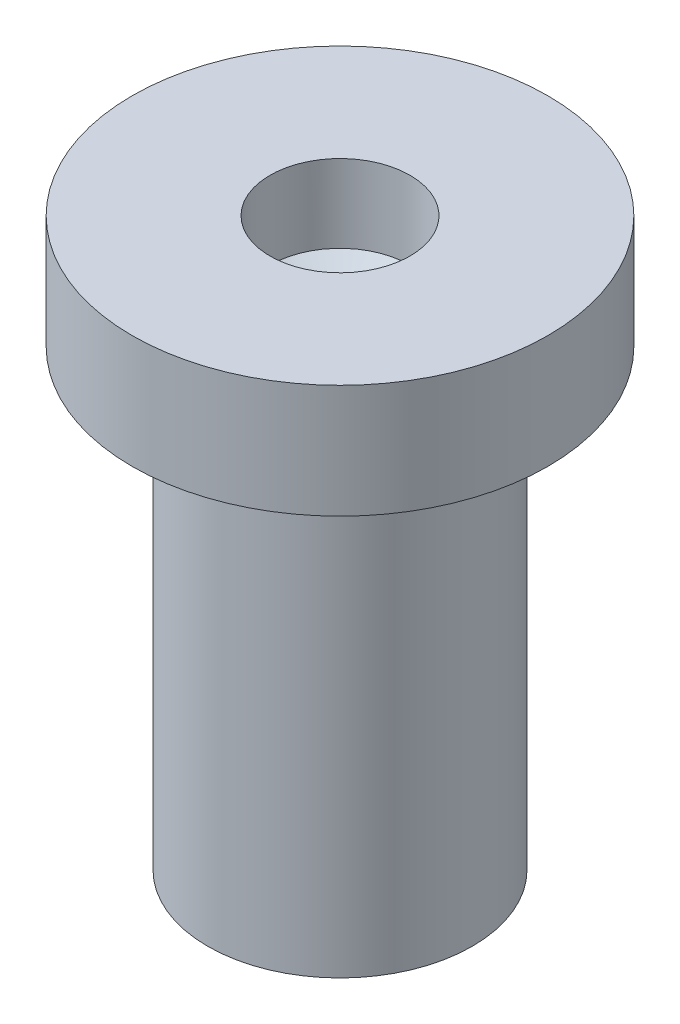
ISO-10303-21;
HEADER;
FILE_DESCRIPTION(('STEP AP214'),'2;1');
FILE_NAME('part.step','',(''),(''),'','','');
FILE_SCHEMA(('AUTOMOTIVE_DESIGN { 1 0 10303 214 1 1 1 1 }'));
ENDSEC;
DATA;
#1=APPLICATION_CONTEXT('core data for automotive mechanical design processes');
#2=APPLICATION_PROTOCOL_DEFINITION('international standard','automotive_design',2000,#1);
#3=PRODUCT_CONTEXT('',#1,'mechanical');
#4=PRODUCT('Part','Part','',(#3));
#5=PRODUCT_RELATED_PRODUCT_CATEGORY('part','',(#4));
#6=PRODUCT_DEFINITION_FORMATION('','',#4);
#7=PRODUCT_DEFINITION_CONTEXT('part definition',#1,'design');
#8=PRODUCT_DEFINITION('design','',#6,#7);
#9=PRODUCT_DEFINITION_SHAPE('','',#8);
#10=(LENGTH_UNIT() NAMED_UNIT(*) SI_UNIT(.MILLI.,.METRE.));
#11=(NAMED_UNIT(*) PLANE_ANGLE_UNIT() SI_UNIT($,.RADIAN.));
#12=(NAMED_UNIT(*) SI_UNIT($,.STERADIAN.) SOLID_ANGLE_UNIT());
#13=UNCERTAINTY_MEASURE_WITH_UNIT(LENGTH_MEASURE(1.E-05),#10,'distance_accuracy_value','');
#14=(GEOMETRIC_REPRESENTATION_CONTEXT(3) GLOBAL_UNCERTAINTY_ASSIGNED_CONTEXT((#13)) GLOBAL_UNIT_ASSIGNED_CONTEXT((#10,
#11,#12)) REPRESENTATION_CONTEXT('',''));
#15=CARTESIAN_POINT('',(0.,0.,0.));
#16=DIRECTION('',(0.,0.,1.));
#17=DIRECTION('',(1.,0.,0.));
#18=AXIS2_PLACEMENT_3D('',#15,#16,#17);
#19=CARTESIAN_POINT('',(0.,6.47053649932942,0.));
#20=DIRECTION('',(0.,1.,0.));
#21=DIRECTION('',(0.,0.,1.));
#22=AXIS2_PLACEMENT_3D('',#19,#20,#21);
#23=CONICAL_SURFACE('',#22,0.926555570704264,1.10090111001775);
#24=CARTESIAN_POINT('',(0.,6.,0.));
#25=VERTEX_POINT('',#24);
#26=VERTEX_LOOP('',#25);
#27=FACE_BOUND('',#26,.T.);
#28=CARTESIAN_POINT('',(0.,6.47053649932942,0.));
#29=DIRECTION('',(0.,-1.,0.));
#30=DIRECTION('',(0.,0.,-1.));
#31=AXIS2_PLACEMENT_3D('',#28,#29,#30);
#32=CIRCLE('',#31,0.926555570704264);
#33=CARTESIAN_POINT('',(0.,6.47053649932942,-0.926555570704264));
#34=VERTEX_POINT('',#33);
#35=EDGE_CURVE('E11',#34,#34,#32,.T.);
#36=ORIENTED_EDGE('',*,*,#35,.F.);
#37=EDGE_LOOP('',(#36));
#38=FACE_BOUND('',#37,.T.);
#39=ADVANCED_FACE('F39',(#27,#38),#23,.F.);
#40=CARTESIAN_POINT('',(0.,0.,0.));
#41=DIRECTION('',(0.,-1.,0.));
#42=DIRECTION('',(0.,0.,-1.));
#43=AXIS2_PLACEMENT_3D('',#40,#41,#42);
#44=CYLINDRICAL_SURFACE('',#43,0.926555570704264);
#45=ORIENTED_EDGE('',*,*,#35,.T.);
#46=EDGE_LOOP('',(#45));
#47=FACE_BOUND('',#46,.T.);
#48=CARTESIAN_POINT('',(0.,7.5,0.));
#49=DIRECTION('',(0.,-1.,0.));
#50=DIRECTION('',(0.,0.,-1.));
#51=AXIS2_PLACEMENT_3D('',#48,#49,#50);
#52=CIRCLE('',#51,0.926555570704264);
#53=CARTESIAN_POINT('',(0.,7.5,-0.926555570704264));
#54=VERTEX_POINT('',#53);
#55=EDGE_CURVE('E46',#54,#54,#52,.T.);
#56=ORIENTED_EDGE('',*,*,#55,.F.);
#57=EDGE_LOOP('',(#56));
#58=FACE_BOUND('',#57,.T.);
#59=ADVANCED_FACE('F51',(#47,#58),#44,.F.);
#60=CARTESIAN_POINT('',(2.75,7.5,0.));
#61=DIRECTION('',(0.,1.,0.));
#62=DIRECTION('',(0.,0.,1.));
#63=AXIS2_PLACEMENT_3D('',#60,#61,#62);
#64=PLANE('',#63);
#65=ORIENTED_EDGE('',*,*,#55,.T.);
#66=EDGE_LOOP('',(#65));
#67=FACE_BOUND('',#66,.T.);
#68=CARTESIAN_POINT('',(0.,7.5,0.));
#69=DIRECTION('',(0.,-1.,0.));
#70=DIRECTION('',(0.,0.,-1.));
#71=AXIS2_PLACEMENT_3D('',#68,#69,#70);
#72=CIRCLE('',#71,2.75);
#73=CARTESIAN_POINT('',(0.,7.5,-2.75));
#74=VERTEX_POINT('',#73);
#75=EDGE_CURVE('E61',#74,#74,#72,.T.);
#76=ORIENTED_EDGE('',*,*,#75,.F.);
#77=EDGE_LOOP('',(#76));
#78=FACE_BOUND('',#77,.T.);
#79=ADVANCED_FACE('F56',(#67,#78),#64,.T.);
#80=CARTESIAN_POINT('',(0.,0.,0.));
#81=DIRECTION('',(0.,-1.,0.));
#82=DIRECTION('',(0.,0.,-1.));
#83=AXIS2_PLACEMENT_3D('',#80,#81,#82);
#84=CYLINDRICAL_SURFACE('',#83,2.75);
#85=ORIENTED_EDGE('',*,*,#75,.T.);
#86=EDGE_LOOP('',(#85));
#87=FACE_BOUND('',#86,.T.);
#88=CARTESIAN_POINT('',(0.,6.,0.));
#89=DIRECTION('',(0.,-1.,0.));
#90=DIRECTION('',(0.,0.,-1.));
#91=AXIS2_PLACEMENT_3D('',#88,#89,#90);
#92=CIRCLE('',#91,2.75);
#93=CARTESIAN_POINT('',(0.,6.,-2.75));
#94=VERTEX_POINT('',#93);
#95=EDGE_CURVE('E64',#94,#94,#92,.T.);
#96=ORIENTED_EDGE('',*,*,#95,.F.);
#97=EDGE_LOOP('',(#96));
#98=FACE_BOUND('',#97,.T.);
#99=ADVANCED_FACE('F91',(#87,#98),#84,.T.);
#100=CARTESIAN_POINT('',(1.75,6.,0.));
#101=DIRECTION('',(0.,-1.,0.));
#102=DIRECTION('',(0.,0.,-1.));
#103=AXIS2_PLACEMENT_3D('',#100,#101,#102);
#104=PLANE('',#103);
#105=ORIENTED_EDGE('',*,*,#95,.T.);
#106=EDGE_LOOP('',(#105));
#107=FACE_BOUND('',#106,.T.);
#108=CARTESIAN_POINT('',(0.,6.,0.));
#109=DIRECTION('',(0.,-1.,0.));
#110=DIRECTION('',(0.,0.,-1.));
#111=AXIS2_PLACEMENT_3D('',#108,#109,#110);
#112=CIRCLE('',#111,1.75);
#113=CARTESIAN_POINT('',(0.,6.,-1.75));
#114=VERTEX_POINT('',#113);
#115=EDGE_CURVE('E70',#114,#114,#112,.T.);
#116=ORIENTED_EDGE('',*,*,#115,.F.);
#117=EDGE_LOOP('',(#116));
#118=FACE_BOUND('',#117,.T.);
#119=ADVANCED_FACE('F83',(#107,#118),#104,.T.);
#120=CARTESIAN_POINT('',(0.,0.,0.));
#121=DIRECTION('',(0.,-1.,0.));
#122=DIRECTION('',(0.,0.,-1.));
#123=AXIS2_PLACEMENT_3D('',#120,#121,#122);
#124=CYLINDRICAL_SURFACE('',#123,1.75);
#125=ORIENTED_EDGE('',*,*,#115,.T.);
#126=EDGE_LOOP('',(#125));
#127=FACE_BOUND('',#126,.T.);
#128=CARTESIAN_POINT('',(0.,0.,0.));
#129=DIRECTION('',(0.,-1.,0.));
#130=DIRECTION('',(0.,0.,-1.));
#131=AXIS2_PLACEMENT_3D('',#128,#129,#130);
#132=CIRCLE('',#131,1.75);
#133=CARTESIAN_POINT('',(0.,0.,-1.75));
#134=VERTEX_POINT('',#133);
#135=EDGE_CURVE('E74',#134,#134,#132,.T.);
#136=ORIENTED_EDGE('',*,*,#135,.F.);
#137=EDGE_LOOP('',(#136));
#138=FACE_BOUND('',#137,.T.);
#139=ADVANCED_FACE('F81',(#127,#138),#124,.T.);
#140=CARTESIAN_POINT('',(1.75,0.,0.));
#141=DIRECTION('',(0.,-1.,0.));
#142=DIRECTION('',(0.,0.,-1.));
#143=AXIS2_PLACEMENT_3D('',#140,#141,#142);
#144=PLANE('',#143);
#145=ORIENTED_EDGE('',*,*,#135,.T.);
#146=EDGE_LOOP('',(#145));
#147=FACE_BOUND('',#146,.T.);
#148=ADVANCED_FACE('F79',(#147),#144,.T.);
#149=CLOSED_SHELL('',(#39,#59,#79,#99,#119,#139,#148));
#150=MANIFOLD_SOLID_BREP('B2',#149);
#151=ADVANCED_BREP_SHAPE_REPRESENTATION('',(#18,#150),#14);
#152=SHAPE_DEFINITION_REPRESENTATION(#9,#151);
ENDSEC;
END-ISO-10303-21;
